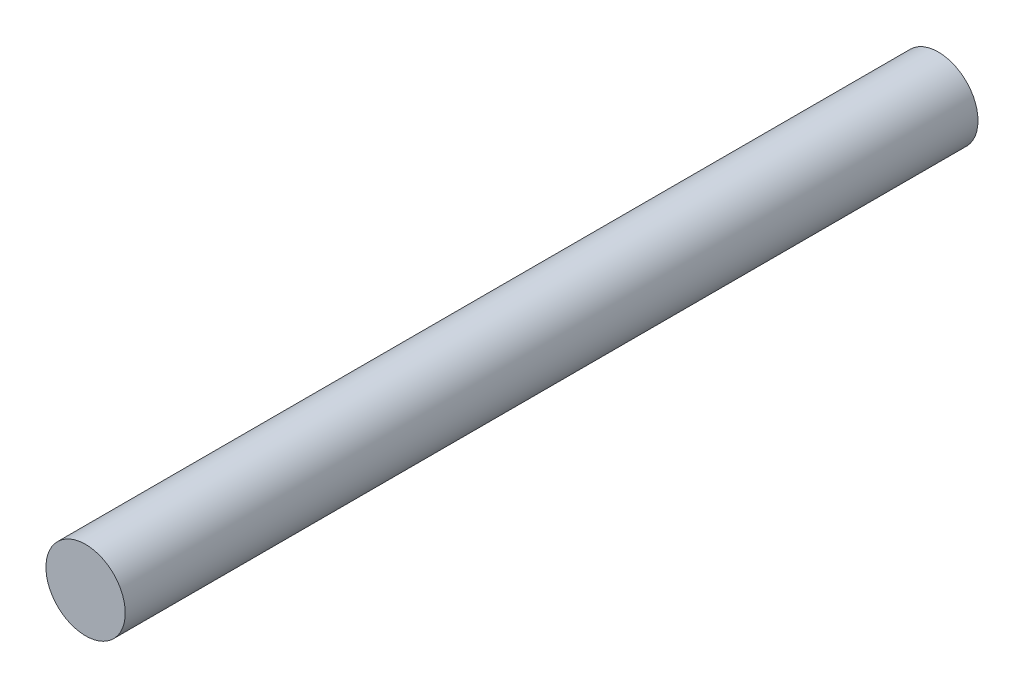
ISO-10303-21;
HEADER;
FILE_DESCRIPTION(('STEP AP214'),'2;1');
FILE_NAME('part.step','',(''),(''),'','','');
FILE_SCHEMA(('AUTOMOTIVE_DESIGN { 1 0 10303 214 1 1 1 1 }'));
ENDSEC;
DATA;
#1=APPLICATION_CONTEXT('core data for automotive mechanical design processes');
#2=APPLICATION_PROTOCOL_DEFINITION('international standard','automotive_design',2000,#1);
#3=PRODUCT_CONTEXT('',#1,'mechanical');
#4=PRODUCT('Part','Part','',(#3));
#5=PRODUCT_RELATED_PRODUCT_CATEGORY('part','',(#4));
#6=PRODUCT_DEFINITION_FORMATION('','',#4);
#7=PRODUCT_DEFINITION_CONTEXT('part definition',#1,'design');
#8=PRODUCT_DEFINITION('design','',#6,#7);
#9=PRODUCT_DEFINITION_SHAPE('','',#8);
#10=(LENGTH_UNIT() NAMED_UNIT(*) SI_UNIT(.MILLI.,.METRE.));
#11=(NAMED_UNIT(*) PLANE_ANGLE_UNIT() SI_UNIT($,.RADIAN.));
#12=(NAMED_UNIT(*) SI_UNIT($,.STERADIAN.) SOLID_ANGLE_UNIT());
#13=UNCERTAINTY_MEASURE_WITH_UNIT(LENGTH_MEASURE(1.E-05),#10,'distance_accuracy_value','');
#14=(GEOMETRIC_REPRESENTATION_CONTEXT(3) GLOBAL_UNCERTAINTY_ASSIGNED_CONTEXT((#13)) GLOBAL_UNIT_ASSIGNED_CONTEXT((#10,
#11,#12)) REPRESENTATION_CONTEXT('',''));
#15=CARTESIAN_POINT('',(0.,0.,0.));
#16=DIRECTION('',(0.,0.,1.));
#17=DIRECTION('',(1.,0.,0.));
#18=AXIS2_PLACEMENT_3D('',#15,#16,#17);
#19=CARTESIAN_POINT('',(0.,0.,-43.));
#20=DIRECTION('',(0.,0.,1.));
#21=DIRECTION('',(1.,0.,0.));
#22=AXIS2_PLACEMENT_3D('',#19,#20,#21);
#23=CYLINDRICAL_SURFACE('',#22,2.);
#24=CARTESIAN_POINT('',(0.,0.,-43.));
#25=DIRECTION('',(0.,0.,1.));
#26=DIRECTION('',(1.,0.,0.));
#27=AXIS2_PLACEMENT_3D('',#24,#25,#26);
#28=CIRCLE('',#27,2.);
#29=CARTESIAN_POINT('',(2.,0.,-43.));
#30=VERTEX_POINT('',#29);
#31=EDGE_CURVE('E10',#30,#30,#28,.T.);
#32=ORIENTED_EDGE('',*,*,#31,.T.);
#33=EDGE_LOOP('',(#32));
#34=FACE_BOUND('',#33,.T.);
#35=CARTESIAN_POINT('',(0.,0.,0.));
#36=DIRECTION('',(0.,0.,1.));
#37=DIRECTION('',(1.,0.,0.));
#38=AXIS2_PLACEMENT_3D('',#35,#36,#37);
#39=CIRCLE('',#38,2.);
#40=CARTESIAN_POINT('',(2.,0.,0.));
#41=VERTEX_POINT('',#40);
#42=EDGE_CURVE('E44',#41,#41,#39,.T.);
#43=ORIENTED_EDGE('',*,*,#42,.F.);
#44=EDGE_LOOP('',(#43));
#45=FACE_BOUND('',#44,.T.);
#46=ADVANCED_FACE('F41',(#34,#45),#23,.T.);
#47=CARTESIAN_POINT('',(0.,0.,-43.));
#48=DIRECTION('',(0.,0.,1.));
#49=DIRECTION('',(1.,0.,0.));
#50=AXIS2_PLACEMENT_3D('',#47,#48,#49);
#51=PLANE('',#50);
#52=ORIENTED_EDGE('',*,*,#31,.F.);
#53=EDGE_LOOP('',(#52));
#54=FACE_BOUND('',#53,.T.);
#55=ADVANCED_FACE('F58',(#54),#51,.F.);
#56=CARTESIAN_POINT('',(0.,0.,0.));
#57=DIRECTION('',(0.,0.,1.));
#58=DIRECTION('',(1.,0.,0.));
#59=AXIS2_PLACEMENT_3D('',#56,#57,#58);
#60=PLANE('',#59);
#61=ORIENTED_EDGE('',*,*,#42,.T.);
#62=EDGE_LOOP('',(#61));
#63=FACE_BOUND('',#62,.T.);
#64=ADVANCED_FACE('F55',(#63),#60,.T.);
#65=CLOSED_SHELL('',(#46,#55,#64));
#66=MANIFOLD_SOLID_BREP('B2',#65);
#67=ADVANCED_BREP_SHAPE_REPRESENTATION('',(#18,#66),#14);
#68=SHAPE_DEFINITION_REPRESENTATION(#9,#67);
ENDSEC;
END-ISO-10303-21;
